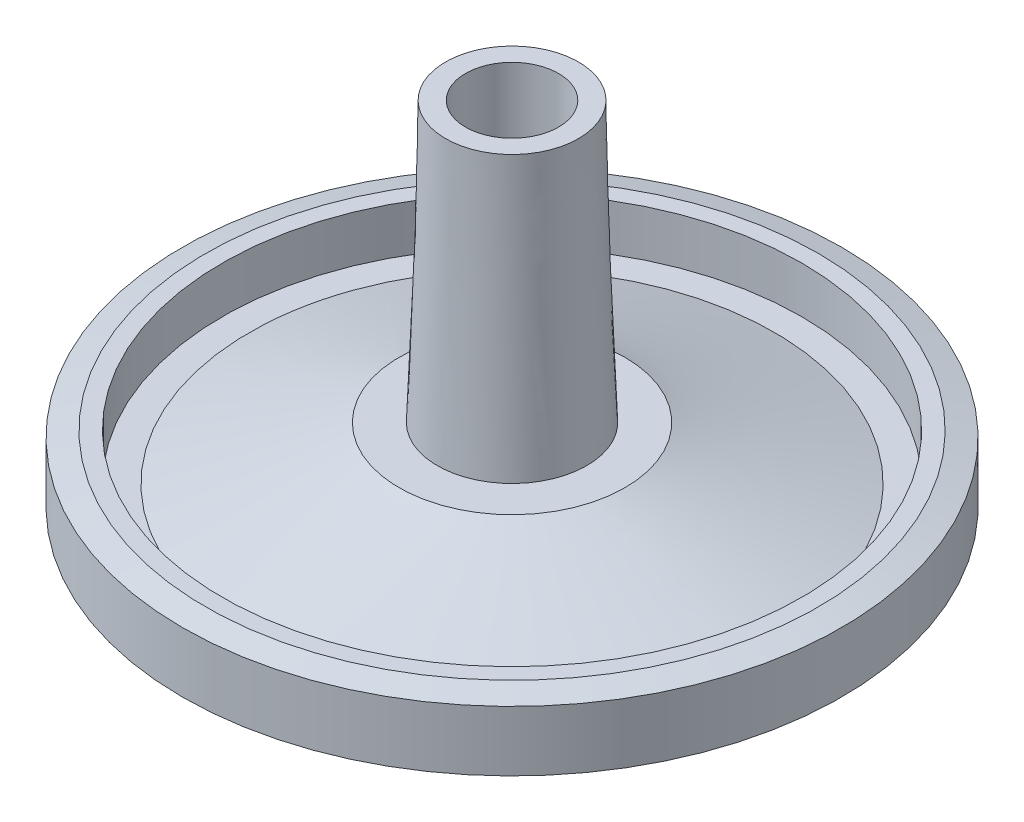
ISO-10303-21;
HEADER;
FILE_DESCRIPTION(('STEP AP214'),'2;1');
FILE_NAME('part.step','',(''),(''),'','','');
FILE_SCHEMA(('AUTOMOTIVE_DESIGN { 1 0 10303 214 1 1 1 1 }'));
ENDSEC;
DATA;
#1=APPLICATION_CONTEXT('core data for automotive mechanical design processes');
#2=APPLICATION_PROTOCOL_DEFINITION('international standard','automotive_design',2000,#1);
#3=PRODUCT_CONTEXT('',#1,'mechanical');
#4=PRODUCT('Part','Part','',(#3));
#5=PRODUCT_RELATED_PRODUCT_CATEGORY('part','',(#4));
#6=PRODUCT_DEFINITION_FORMATION('','',#4);
#7=PRODUCT_DEFINITION_CONTEXT('part definition',#1,'design');
#8=PRODUCT_DEFINITION('design','',#6,#7);
#9=PRODUCT_DEFINITION_SHAPE('','',#8);
#10=(LENGTH_UNIT() NAMED_UNIT(*) SI_UNIT(.MILLI.,.METRE.));
#11=(NAMED_UNIT(*) PLANE_ANGLE_UNIT() SI_UNIT($,.RADIAN.));
#12=(NAMED_UNIT(*) SI_UNIT($,.STERADIAN.) SOLID_ANGLE_UNIT());
#13=UNCERTAINTY_MEASURE_WITH_UNIT(LENGTH_MEASURE(1.E-05),#10,'distance_accuracy_value','');
#14=(GEOMETRIC_REPRESENTATION_CONTEXT(3) GLOBAL_UNCERTAINTY_ASSIGNED_CONTEXT((#13)) GLOBAL_UNIT_ASSIGNED_CONTEXT((#10,
#11,#12)) REPRESENTATION_CONTEXT('',''));
#15=CARTESIAN_POINT('',(0.,0.,0.));
#16=DIRECTION('',(0.,0.,1.));
#17=DIRECTION('',(1.,0.,0.));
#18=AXIS2_PLACEMENT_3D('',#15,#16,#17);
#19=CARTESIAN_POINT('',(0.,-26.5,0.));
#20=DIRECTION('',(0.,-1.,0.));
#21=DIRECTION('',(0.,0.,-1.));
#22=AXIS2_PLACEMENT_3D('',#19,#20,#21);
#23=PLANE('',#22);
#24=CARTESIAN_POINT('',(0.,-26.5,0.));
#25=DIRECTION('',(0.,-1.,0.));
#26=DIRECTION('',(0.,0.,-1.));
#27=AXIS2_PLACEMENT_3D('',#24,#25,#26);
#28=CIRCLE('',#27,19.5);
#29=CARTESIAN_POINT('',(0.,-26.5,-19.5));
#30=VERTEX_POINT('',#29);
#31=EDGE_CURVE('E70',#30,#30,#28,.F.);
#32=ORIENTED_EDGE('',*,*,#31,.T.);
#33=EDGE_LOOP('',(#32));
#34=FACE_BOUND('',#33,.T.);
#35=CARTESIAN_POINT('',(0.,-26.5,0.));
#36=DIRECTION('',(0.,1.,0.));
#37=DIRECTION('',(0.,0.,1.));
#38=AXIS2_PLACEMENT_3D('',#35,#36,#37);
#39=CIRCLE('',#38,20.);
#40=CARTESIAN_POINT('',(0.,-26.5,-20.));
#41=VERTEX_POINT('',#40);
#42=CARTESIAN_POINT('',(0.,-26.5,20.));
#43=VERTEX_POINT('',#42);
#44=EDGE_CURVE('E61',#41,#43,#39,.F.);
#45=ORIENTED_EDGE('',*,*,#44,.T.);
#46=CARTESIAN_POINT('',(0.,-26.5,0.));
#47=DIRECTION('',(0.,1.,0.));
#48=DIRECTION('',(0.,0.,-1.));
#49=AXIS2_PLACEMENT_3D('',#46,#47,#48);
#50=CIRCLE('',#49,20.);
#51=EDGE_CURVE('E58',#43,#41,#50,.F.);
#52=ORIENTED_EDGE('',*,*,#51,.T.);
#53=EDGE_LOOP('',(#45,#52));
#54=FACE_BOUND('',#53,.T.);
#55=ADVANCED_FACE('F17',(#34,#54),#23,.T.);
#56=CARTESIAN_POINT('',(0.,-26.5,0.));
#57=DIRECTION('',(0.,-1.,0.));
#58=DIRECTION('',(0.,0.,-1.));
#59=AXIS2_PLACEMENT_3D('',#56,#57,#58);
#60=CONICAL_SURFACE('',#59,19.5,1.27933953231703);
#61=ORIENTED_EDGE('',*,*,#31,.F.);
#62=EDGE_LOOP('',(#61));
#63=FACE_BOUND('',#62,.T.);
#64=CARTESIAN_POINT('',(0.,-23.5,0.));
#65=DIRECTION('',(0.,-1.,0.));
#66=DIRECTION('',(0.,0.,-1.));
#67=AXIS2_PLACEMENT_3D('',#64,#65,#66);
#68=CIRCLE('',#67,9.5);
#69=CARTESIAN_POINT('',(0.,-23.5,-9.5));
#70=VERTEX_POINT('',#69);
#71=EDGE_CURVE('E65',#70,#70,#68,.T.);
#72=ORIENTED_EDGE('',*,*,#71,.F.);
#73=EDGE_LOOP('',(#72));
#74=FACE_BOUND('',#73,.T.);
#75=ADVANCED_FACE('F119',(#63,#74),#60,.F.);
#76=CARTESIAN_POINT('',(0.,-27.,0.));
#77=DIRECTION('',(0.,-1.,0.));
#78=DIRECTION('',(0.,0.,-1.));
#79=AXIS2_PLACEMENT_3D('',#76,#77,#78);
#80=TOROIDAL_SURFACE('',#79,20.,0.5);
#81=ORIENTED_EDGE('',*,*,#44,.F.);
#82=ORIENTED_EDGE('',*,*,#51,.F.);
#83=EDGE_LOOP('',(#81,#82));
#84=FACE_BOUND('',#83,.T.);
#85=CARTESIAN_POINT('',(0.,-27.,0.));
#86=DIRECTION('',(0.,-1.,0.));
#87=DIRECTION('',(0.,0.,-1.));
#88=AXIS2_PLACEMENT_3D('',#85,#86,#87);
#89=CIRCLE('',#88,20.5);
#90=CARTESIAN_POINT('',(0.,-27.,-20.5));
#91=VERTEX_POINT('',#90);
#92=EDGE_CURVE('E108',#91,#91,#89,.F.);
#93=ORIENTED_EDGE('',*,*,#92,.F.);
#94=EDGE_LOOP('',(#93));
#95=FACE_BOUND('',#94,.T.);
#96=ADVANCED_FACE('F68',(#84,#95),#80,.F.);
#97=CARTESIAN_POINT('',(0.,-23.5,0.));
#98=DIRECTION('',(0.,-1.,0.));
#99=DIRECTION('',(0.,0.,-1.));
#100=AXIS2_PLACEMENT_3D('',#97,#98,#99);
#101=PLANE('',#100);
#102=ORIENTED_EDGE('',*,*,#71,.T.);
#103=EDGE_LOOP('',(#102));
#104=FACE_BOUND('',#103,.T.);
#105=CARTESIAN_POINT('',(0.,-23.5,0.));
#106=DIRECTION('',(0.,1.,0.));
#107=DIRECTION('',(0.,0.,1.));
#108=AXIS2_PLACEMENT_3D('',#105,#106,#107);
#109=CIRCLE('',#108,5.);
#110=CARTESIAN_POINT('',(-4.33535350582245,-23.5,-2.49092552669746));
#111=VERTEX_POINT('',#110);
#112=EDGE_CURVE('E115',#111,#111,#109,.T.);
#113=ORIENTED_EDGE('',*,*,#112,.T.);
#114=EDGE_LOOP('',(#113));
#115=FACE_BOUND('',#114,.T.);
#116=ADVANCED_FACE('F89',(#104,#115),#101,.T.);
#117=CARTESIAN_POINT('',(0.,-27.,0.));
#118=DIRECTION('',(0.,-1.,0.));
#119=DIRECTION('',(0.,0.,-1.));
#120=AXIS2_PLACEMENT_3D('',#117,#118,#119);
#121=TOROIDAL_SURFACE('',#120,21.,0.5);
#122=ORIENTED_EDGE('',*,*,#92,.T.);
#123=EDGE_LOOP('',(#122));
#124=FACE_BOUND('',#123,.T.);
#125=CARTESIAN_POINT('',(0.,-27.5,0.));
#126=DIRECTION('',(0.,-1.,0.));
#127=DIRECTION('',(0.,0.,-1.));
#128=AXIS2_PLACEMENT_3D('',#125,#126,#127);
#129=CIRCLE('',#128,21.);
#130=CARTESIAN_POINT('',(0.,-27.5,21.));
#131=VERTEX_POINT('',#130);
#132=CARTESIAN_POINT('',(0.,-27.5,-21.));
#133=VERTEX_POINT('',#132);
#134=EDGE_CURVE('E103',#131,#133,#129,.F.);
#135=ORIENTED_EDGE('',*,*,#134,.F.);
#136=CARTESIAN_POINT('',(0.,-27.5,0.));
#137=DIRECTION('',(0.,-1.,0.));
#138=DIRECTION('',(0.,0.,1.));
#139=AXIS2_PLACEMENT_3D('',#136,#137,#138);
#140=CIRCLE('',#139,21.);
#141=EDGE_CURVE('E172',#133,#131,#140,.F.);
#142=ORIENTED_EDGE('',*,*,#141,.F.);
#143=EDGE_LOOP('',(#135,#142));
#144=FACE_BOUND('',#143,.T.);
#145=ADVANCED_FACE('F77',(#124,#144),#121,.T.);
#146=CARTESIAN_POINT('',(-4.33535350582245,-23.5,-2.49092552669746));
#147=CARTESIAN_POINT('',(-3.67256262126757,-19.5,0.758144968240403));
#148=CARTESIAN_POINT('',(-9.31720455921736,-23.5,6.17978148494744));
#149=CARTESIAN_POINT('',(-2.15627268478677,-19.5,8.10327021077555));
#150=CARTESIAN_POINT('',(-0.646497547572471,-23.5,11.1616325383424));
#151=CARTESIAN_POINT('',(5.18885255774838,-19.5,6.58698027429475));
#152=CARTESIAN_POINT('',(4.33535350582245,-23.5,2.49092552669746));
#153=CARTESIAN_POINT('',(3.67256262126757,-19.5,-0.758144968240403));
#154=CARTESIAN_POINT('',(9.31720455921737,-23.5,-6.17978148494744));
#155=CARTESIAN_POINT('',(2.15627268478677,-19.5,-8.10327021077554));
#156=CARTESIAN_POINT('',(0.646497547572464,-23.5,-11.1616325383424));
#157=CARTESIAN_POINT('',(-5.18885255774838,-19.5,-6.58698027429474));
#158=CARTESIAN_POINT('',(-4.33535350582245,-23.5,-2.49092552669746));
#159=CARTESIAN_POINT('',(-3.67256262126757,-19.5,0.758144968240403));
#160=(BOUNDED_SURFACE() B_SPLINE_SURFACE(3,1,((#146,#147),(#148,#149),(#150,#151),(#152,#153),
(#154,#155),(#156,#157),(#158,#159)),.UNSPECIFIED.,.T.,.F.,.F.) B_SPLINE_SURFACE_WITH_KNOTS((4,
3,4),(2,2),(0.,0.5,1.),(0.,1.),
.UNSPECIFIED.) GEOMETRIC_REPRESENTATION_ITEM() RATIONAL_B_SPLINE_SURFACE(((1.,1.),
(0.333333333333333,0.333333333333333),(0.333333333333333,0.333333333333333),(1.,1.),
(0.333333333333333,0.333333333333334),(0.333333333333333,0.333333333333334),(1.,1.))) REPRESENTATION_ITEM('') SURFACE());
#161=CARTESIAN_POINT('',(0.,-19.5,0.));
#162=DIRECTION('',(0.,-1.,0.));
#163=DIRECTION('',(0.,0.,-1.));
#164=AXIS2_PLACEMENT_3D('',#161,#162,#163);
#165=CIRCLE('',#164,3.75);
#166=CARTESIAN_POINT('',(-3.67256262126757,-19.5,0.758144968240403));
#167=VERTEX_POINT('',#166);
#168=EDGE_CURVE('E99',#167,#167,#165,.F.);
#169=CARTESIAN_POINT('',(-4.33535350582245,-23.5,-2.49092552669746));
#170=CARTESIAN_POINT('',(-4.32844943410834,-23.4583333333333,-2.45708104237519));
#171=CARTESIAN_POINT('',(-4.32154536239422,-23.4166666666667,-2.42323655805292));
#172=CARTESIAN_POINT('',(-4.30773721896599,-23.3333333333333,-2.35554758940838));
#173=CARTESIAN_POINT('',(-4.30083314725188,-23.2916666666667,-2.32170310508611));
#174=CARTESIAN_POINT('',(-4.28702500382365,-23.2083333333333,-2.25401413644157));
#175=CARTESIAN_POINT('',(-4.28012093210954,-23.1666666666667,-2.2201696521193));
#176=CARTESIAN_POINT('',(-4.26631278868132,-23.0833333333333,-2.15248068347476));
#177=CARTESIAN_POINT('',(-4.2594087169672,-23.0416666666667,-2.11863619915249));
#178=CARTESIAN_POINT('',(-4.24560057353898,-22.9583333333333,-2.05094723050796));
#179=CARTESIAN_POINT('',(-4.23869650182486,-22.9166666666667,-2.01710274618569));
#180=CARTESIAN_POINT('',(-4.22488835839664,-22.8333333333333,-1.94941377754115));
#181=CARTESIAN_POINT('',(-4.21798428668252,-22.7916666666667,-1.91556929321888));
#182=CARTESIAN_POINT('',(-4.2041761432543,-22.7083333333333,-1.84788032457434));
#183=CARTESIAN_POINT('',(-4.19727207154018,-22.6666666666667,-1.81403584025207));
#184=CARTESIAN_POINT('',(-4.18346392811196,-22.5833333333333,-1.74634687160753));
#185=CARTESIAN_POINT('',(-4.17655985639784,-22.5416666666667,-1.71250238728526));
#186=CARTESIAN_POINT('',(-4.16275171296962,-22.4583333333333,-1.64481341864072));
#187=CARTESIAN_POINT('',(-4.1558476412555,-22.4166666666667,-1.61096893431845));
#188=CARTESIAN_POINT('',(-4.14203949782728,-22.3333333333333,-1.54327996567392));
#189=CARTESIAN_POINT('',(-4.13513542611316,-22.2916666666667,-1.50943548135165));
#190=CARTESIAN_POINT('',(-4.12132728268494,-22.2083333333333,-1.44174651270711));
#191=CARTESIAN_POINT('',(-4.11442321097082,-22.1666666666667,-1.40790202838484));
#192=CARTESIAN_POINT('',(-4.1006150675426,-22.0833333333333,-1.3402130597403));
#193=CARTESIAN_POINT('',(-4.09371099582848,-22.0416666666667,-1.30636857541803));
#194=CARTESIAN_POINT('',(-4.07990285240026,-21.9583333333333,-1.23867960677349));
#195=CARTESIAN_POINT('',(-4.07299878068614,-21.9166666666667,-1.20483512245122));
#196=CARTESIAN_POINT('',(-4.05919063725792,-21.8333333333333,-1.13714615380668));
#197=CARTESIAN_POINT('',(-4.0522865655438,-21.7916666666667,-1.10330166948441));
#198=CARTESIAN_POINT('',(-4.03847842211558,-21.7083333333333,-1.03561270083988));
#199=CARTESIAN_POINT('',(-4.03157435040146,-21.6666666666667,-1.00176821651761));
#200=CARTESIAN_POINT('',(-4.01776620697324,-21.5833333333333,-0.934079247873066));
#201=CARTESIAN_POINT('',(-4.01086213525912,-21.5416666666667,-0.900234763550797));
#202=CARTESIAN_POINT('',(-3.9970539918309,-21.4583333333333,-0.832545794906259));
#203=CARTESIAN_POINT('',(-3.99014992011678,-21.4166666666667,-0.798701310583989));
#204=CARTESIAN_POINT('',(-3.97634177668856,-21.3333333333333,-0.73101234193945));
#205=CARTESIAN_POINT('',(-3.96943770497445,-21.2916666666667,-0.697167857617181));
#206=CARTESIAN_POINT('',(-3.95562956154622,-21.2083333333333,-0.629478888972642));
#207=CARTESIAN_POINT('',(-3.9487254898321,-21.1666666666667,-0.595634404650373));
#208=CARTESIAN_POINT('',(-3.93491734640388,-21.0833333333333,-0.527945436005834));
#209=CARTESIAN_POINT('',(-3.92801327468977,-21.0416666666667,-0.494100951683565));
#210=CARTESIAN_POINT('',(-3.91420513126154,-20.9583333333333,-0.426411983039026));
#211=CARTESIAN_POINT('',(-3.90730105954743,-20.9166666666667,-0.392567498716756));
#212=CARTESIAN_POINT('',(-3.8934929161192,-20.8333333333333,-0.324878530072218));
#213=CARTESIAN_POINT('',(-3.88658884440509,-20.7916666666667,-0.291034045749948));
#214=CARTESIAN_POINT('',(-3.87278070097686,-20.7083333333333,-0.223345077105409));
#215=CARTESIAN_POINT('',(-3.86587662926275,-20.6666666666667,-0.18950059278314));
#216=CARTESIAN_POINT('',(-3.85206848583452,-20.5833333333333,-0.121811624138601));
#217=CARTESIAN_POINT('',(-3.84516441412041,-20.5416666666667,-0.0879671398163318));
#218=CARTESIAN_POINT('',(-3.83135627069218,-20.4583333333333,-0.020278171171793));
#219=CARTESIAN_POINT('',(-3.82445219897807,-20.4166666666667,0.0135663131504763));
#220=CARTESIAN_POINT('',(-3.81064405554984,-20.3333333333333,0.0812552817950151));
#221=CARTESIAN_POINT('',(-3.80373998383573,-20.2916666666667,0.115099766117284));
#222=CARTESIAN_POINT('',(-3.7899318404075,-20.2083333333333,0.182788734761823));
#223=CARTESIAN_POINT('',(-3.78302776869339,-20.1666666666667,0.216633219084093));
#224=CARTESIAN_POINT('',(-3.76921962526516,-20.0833333333333,0.284322187728631));
#225=CARTESIAN_POINT('',(-3.76231555355105,-20.0416666666667,0.3181666720509));
#226=CARTESIAN_POINT('',(-3.74850741012282,-19.9583333333333,0.385855640695439));
#227=CARTESIAN_POINT('',(-3.74160333840871,-19.9166666666667,0.419700125017709));
#228=CARTESIAN_POINT('',(-3.72779519498048,-19.8333333333333,0.487389093662248));
#229=CARTESIAN_POINT('',(-3.72089112326637,-19.7916666666667,0.521233577984517));
#230=CARTESIAN_POINT('',(-3.70708297983814,-19.7083333333333,0.588922546629056));
#231=CARTESIAN_POINT('',(-3.70017890812403,-19.6666666666667,0.622767030951325));
#232=CARTESIAN_POINT('',(-3.6863707646958,-19.5833333333333,0.690455999595864));
#233=CARTESIAN_POINT('',(-3.67946669298169,-19.5416666666667,0.724300483918134));
#234=CARTESIAN_POINT('',(-3.67256262126757,-19.5,0.758144968240403));
#235=B_SPLINE_CURVE_WITH_KNOTS('',3,(#169,#170,#171,#172,#173,#174,#175,#176,#177,#178,#179,
#180,#181,#182,#183,#184,#185,#186,#187,#188,#189,#190,#191,#192,#193,#194,#195,#196,#197,#198,
#199,#200,#201,#202,#203,#204,#205,#206,#207,#208,#209,#210,#211,#212,#213,#214,#215,#216,#217,
#218,#219,#220,#221,#222,#223,#224,#225,#226,#227,#228,#229,#230,#231,#232,#233,#234),
.UNSPECIFIED.,.F.,.F.,(4,2,2,2,2,2,2,2,2,2,2,2,2,2,2,2,2,2,2,2,2,2,2,2,2,2,2,2,2,2,2,2,4),(0.,
0.162366985337123,0.324733970674247,0.48710095601137,0.649467941348491,0.811834926685617,
0.97420191202274,1.13656889735986,1.29893588269699,1.46130286803411,1.62366985337123,
1.78603683870836,1.94840382404548,2.1107708093826,2.27313779471973,2.43550478005685,
2.59787176539397,2.76023875073109,2.92260573606822,3.08497272140534,3.24733970674247,
3.40970669207959,3.57207367741671,3.73444066275384,3.89680764809096,4.05917463342808,
4.22154161876521,4.38390860410233,4.54627558943945,4.70864257477657,4.8710095601137,
5.03337654545082,5.19574353078794),.UNSPECIFIED.);
#236=EDGE_CURVE('',#111,#167,#235,.T.);
#237=ORIENTED_EDGE('',*,*,#112,.F.);
#238=ORIENTED_EDGE('',*,*,#168,.T.);
#239=ORIENTED_EDGE('',*,*,#236,.T.);
#240=ORIENTED_EDGE('',*,*,#236,.F.);
#241=EDGE_LOOP('',(#237,#239,#238,#240));
#242=FACE_BOUND('',#241,.T.);
#243=ADVANCED_FACE('F88',(#242),#160,.F.);
#244=CARTESIAN_POINT('',(0.,-27.5,0.));
#245=DIRECTION('',(0.,-1.,0.));
#246=DIRECTION('',(0.,0.,-1.));
#247=AXIS2_PLACEMENT_3D('',#244,#245,#246);
#248=PLANE('',#247);
#249=ORIENTED_EDGE('',*,*,#141,.T.);
#250=ORIENTED_EDGE('',*,*,#134,.T.);
#251=EDGE_LOOP('',(#249,#250));
#252=FACE_BOUND('',#251,.T.);
#253=CARTESIAN_POINT('',(0.,-27.5,0.));
#254=DIRECTION('',(0.,1.,0.));
#255=DIRECTION('',(0.,0.,1.));
#256=AXIS2_PLACEMENT_3D('',#253,#254,#255);
#257=CIRCLE('',#256,22.);
#258=CARTESIAN_POINT('',(0.,-27.5,22.));
#259=VERTEX_POINT('',#258);
#260=CARTESIAN_POINT('',(0.,-27.5,-22.));
#261=VERTEX_POINT('',#260);
#262=EDGE_CURVE('E169',#259,#261,#257,.T.);
#263=ORIENTED_EDGE('',*,*,#262,.F.);
#264=CARTESIAN_POINT('',(0.,-27.5,0.));
#265=DIRECTION('',(0.,1.,0.));
#266=DIRECTION('',(0.,0.,-1.));
#267=AXIS2_PLACEMENT_3D('',#264,#265,#266);
#268=CIRCLE('',#267,22.);
#269=EDGE_CURVE('E275',#261,#259,#268,.T.);
#270=ORIENTED_EDGE('',*,*,#269,.F.);
#271=EDGE_LOOP('',(#263,#270));
#272=FACE_BOUND('',#271,.T.);
#273=ADVANCED_FACE('F247',(#252,#272),#248,.T.);
#274=CARTESIAN_POINT('',(0.,-10.,0.));
#275=DIRECTION('',(0.,-1.,0.));
#276=DIRECTION('',(0.,0.,-1.));
#277=AXIS2_PLACEMENT_3D('',#274,#275,#276);
#278=CYLINDRICAL_SURFACE('',#277,3.75);
#279=ORIENTED_EDGE('',*,*,#168,.F.);
#280=EDGE_LOOP('',(#279));
#281=FACE_BOUND('',#280,.T.);
#282=CARTESIAN_POINT('',(0.,-10.,0.));
#283=DIRECTION('',(0.,-1.,0.));
#284=DIRECTION('',(0.,0.,-1.));
#285=AXIS2_PLACEMENT_3D('',#282,#283,#284);
#286=CIRCLE('',#285,3.75);
#287=CARTESIAN_POINT('',(0.,-10.,-3.75));
#288=VERTEX_POINT('',#287);
#289=EDGE_CURVE('E166',#288,#288,#286,.T.);
#290=ORIENTED_EDGE('',*,*,#289,.F.);
#291=EDGE_LOOP('',(#290));
#292=FACE_BOUND('',#291,.T.);
#293=ADVANCED_FACE('F223',(#281,#292),#278,.F.);
#294=CARTESIAN_POINT('',(0.,-27.,0.));
#295=DIRECTION('',(0.,-1.,0.));
#296=DIRECTION('',(0.,0.,-1.));
#297=AXIS2_PLACEMENT_3D('',#294,#295,#296);
#298=TOROIDAL_SURFACE('',#297,22.,0.5);
#299=ORIENTED_EDGE('',*,*,#269,.T.);
#300=ORIENTED_EDGE('',*,*,#262,.T.);
#301=EDGE_LOOP('',(#299,#300));
#302=FACE_BOUND('',#301,.T.);
#303=CARTESIAN_POINT('',(0.,-27.,0.));
#304=DIRECTION('',(0.,-1.,0.));
#305=DIRECTION('',(0.,0.,-1.));
#306=AXIS2_PLACEMENT_3D('',#303,#304,#305);
#307=CIRCLE('',#306,22.5);
#308=CARTESIAN_POINT('',(0.,-27.,-22.5));
#309=VERTEX_POINT('',#308);
#310=EDGE_CURVE('E165',#309,#309,#307,.T.);
#311=ORIENTED_EDGE('',*,*,#310,.T.);
#312=EDGE_LOOP('',(#311));
#313=FACE_BOUND('',#312,.T.);
#314=ADVANCED_FACE('F219',(#302,#313),#298,.T.);
#315=CARTESIAN_POINT('',(0.,-10.,0.));
#316=DIRECTION('',(0.,-1.,0.));
#317=DIRECTION('',(0.,0.,-1.));
#318=AXIS2_PLACEMENT_3D('',#315,#316,#317);
#319=PLANE('',#318);
#320=ORIENTED_EDGE('',*,*,#289,.T.);
#321=EDGE_LOOP('',(#320));
#322=FACE_BOUND('',#321,.T.);
#323=CARTESIAN_POINT('',(0.,-10.,0.));
#324=DIRECTION('',(0.,-1.,0.));
#325=DIRECTION('',(0.,0.,-1.));
#326=AXIS2_PLACEMENT_3D('',#323,#324,#325);
#327=CIRCLE('',#326,2.5);
#328=CARTESIAN_POINT('',(0.,-10.,-2.5));
#329=VERTEX_POINT('',#328);
#330=EDGE_CURVE('E161',#329,#329,#327,.F.);
#331=ORIENTED_EDGE('',*,*,#330,.T.);
#332=EDGE_LOOP('',(#331));
#333=FACE_BOUND('',#332,.T.);
#334=ADVANCED_FACE('F194',(#322,#333),#319,.T.);
#335=CARTESIAN_POINT('',(0.,-27.,0.));
#336=DIRECTION('',(0.,-1.,0.));
#337=DIRECTION('',(0.,0.,-1.));
#338=AXIS2_PLACEMENT_3D('',#335,#336,#337);
#339=TOROIDAL_SURFACE('',#338,23.,0.5);
#340=ORIENTED_EDGE('',*,*,#310,.F.);
#341=EDGE_LOOP('',(#340));
#342=FACE_BOUND('',#341,.T.);
#343=CARTESIAN_POINT('',(0.,-26.5,0.));
#344=DIRECTION('',(0.,-1.,0.));
#345=DIRECTION('',(0.,0.,1.));
#346=AXIS2_PLACEMENT_3D('',#343,#344,#345);
#347=CIRCLE('',#346,23.);
#348=CARTESIAN_POINT('',(0.,-26.5,-23.));
#349=VERTEX_POINT('',#348);
#350=CARTESIAN_POINT('',(0.,-26.5,23.));
#351=VERTEX_POINT('',#350);
#352=EDGE_CURVE('E164',#349,#351,#347,.F.);
#353=ORIENTED_EDGE('',*,*,#352,.F.);
#354=CARTESIAN_POINT('',(0.,-26.5,0.));
#355=DIRECTION('',(0.,-1.,0.));
#356=DIRECTION('',(0.,0.,-1.));
#357=AXIS2_PLACEMENT_3D('',#354,#355,#356);
#358=CIRCLE('',#357,23.);
#359=EDGE_CURVE('E37',#351,#349,#358,.F.);
#360=ORIENTED_EDGE('',*,*,#359,.F.);
#361=EDGE_LOOP('',(#353,#360));
#362=FACE_BOUND('',#361,.T.);
#363=ADVANCED_FACE('F182',(#342,#362),#339,.F.);
#364=CARTESIAN_POINT('',(0.,0.00209999999999967,0.));
#365=DIRECTION('',(0.,-1.,0.));
#366=DIRECTION('',(0.,0.,-1.));
#367=AXIS2_PLACEMENT_3D('',#364,#365,#366);
#368=CYLINDRICAL_SURFACE('',#367,2.5);
#369=CARTESIAN_POINT('',(0.,-8.5,0.));
#370=DIRECTION('',(0.,-1.,0.));
#371=DIRECTION('',(0.,0.,-1.));
#372=AXIS2_PLACEMENT_3D('',#369,#370,#371);
#373=CIRCLE('',#372,2.5);
#374=CARTESIAN_POINT('',(0.,-8.5,-2.5));
#375=VERTEX_POINT('',#374);
#376=EDGE_CURVE('E158',#375,#375,#373,.T.);
#377=ORIENTED_EDGE('',*,*,#376,.F.);
#378=EDGE_LOOP('',(#377));
#379=FACE_BOUND('',#378,.T.);
#380=ORIENTED_EDGE('',*,*,#330,.F.);
#381=EDGE_LOOP('',(#380));
#382=FACE_BOUND('',#381,.T.);
#383=ADVANCED_FACE('F193',(#379,#382),#368,.F.);
#384=CARTESIAN_POINT('',(0.,-26.5,0.));
#385=DIRECTION('',(0.,-1.,0.));
#386=DIRECTION('',(0.,0.,-1.));
#387=AXIS2_PLACEMENT_3D('',#384,#385,#386);
#388=PLANE('',#387);
#389=CARTESIAN_POINT('',(0.,-26.5,0.));
#390=DIRECTION('',(0.,1.,0.));
#391=DIRECTION('',(0.,0.,1.));
#392=AXIS2_PLACEMENT_3D('',#389,#390,#391);
#393=CIRCLE('',#392,24.8);
#394=CARTESIAN_POINT('',(0.,-26.5,24.8));
#395=VERTEX_POINT('',#394);
#396=EDGE_CURVE('E155',#395,#395,#393,.T.);
#397=ORIENTED_EDGE('',*,*,#396,.F.);
#398=EDGE_LOOP('',(#397));
#399=FACE_BOUND('',#398,.T.);
#400=ORIENTED_EDGE('',*,*,#352,.T.);
#401=ORIENTED_EDGE('',*,*,#359,.T.);
#402=EDGE_LOOP('',(#400,#401));
#403=FACE_BOUND('',#402,.T.);
#404=ADVANCED_FACE('F290',(#399,#403),#388,.T.);
#405=CARTESIAN_POINT('',(0.,-8.5,0.));
#406=DIRECTION('',(0.,1.,0.));
#407=DIRECTION('',(0.,0.,1.));
#408=AXIS2_PLACEMENT_3D('',#405,#406,#407);
#409=PLANE('',#408);
#410=CARTESIAN_POINT('',(0.,-8.5,0.));
#411=DIRECTION('',(0.,1.,0.));
#412=DIRECTION('',(0.,0.,1.));
#413=AXIS2_PLACEMENT_3D('',#410,#411,#412);
#414=CIRCLE('',#413,3.5);
#415=CARTESIAN_POINT('',(0.,-8.5,3.5));
#416=VERTEX_POINT('',#415);
#417=EDGE_CURVE('E152',#416,#416,#414,.T.);
#418=ORIENTED_EDGE('',*,*,#417,.T.);
#419=EDGE_LOOP('',(#418));
#420=FACE_BOUND('',#419,.T.);
#421=ORIENTED_EDGE('',*,*,#376,.T.);
#422=EDGE_LOOP('',(#421));
#423=FACE_BOUND('',#422,.T.);
#424=ADVANCED_FACE('F296',(#420,#423),#409,.T.);
#425=CARTESIAN_POINT('',(0.,-26.5,0.));
#426=DIRECTION('',(0.,1.,0.));
#427=DIRECTION('',(0.,0.,1.));
#428=AXIS2_PLACEMENT_3D('',#425,#426,#427);
#429=CYLINDRICAL_SURFACE('',#428,24.8);
#430=ORIENTED_EDGE('',*,*,#396,.T.);
#431=EDGE_LOOP('',(#430));
#432=FACE_BOUND('',#431,.T.);
#433=CARTESIAN_POINT('',(0.,-21.9689110867545,0.));
#434=DIRECTION('',(0.,-1.,0.));
#435=DIRECTION('',(0.,0.,-1.));
#436=AXIS2_PLACEMENT_3D('',#433,#434,#435);
#437=CIRCLE('',#436,24.8);
#438=CARTESIAN_POINT('',(0.,-21.9689110867545,-24.8));
#439=VERTEX_POINT('',#438);
#440=EDGE_CURVE('E151',#439,#439,#437,.F.);
#441=ORIENTED_EDGE('',*,*,#440,.F.);
#442=EDGE_LOOP('',(#441));
#443=FACE_BOUND('',#442,.T.);
#444=ADVANCED_FACE('F352',(#432,#443),#429,.T.);
#445=CARTESIAN_POINT('',(0.,-8.5,0.));
#446=DIRECTION('',(0.,1.,0.));
#447=DIRECTION('',(0.,0.,1.));
#448=AXIS2_PLACEMENT_3D('',#445,#446,#447);
#449=CYLINDRICAL_SURFACE('',#448,3.5);
#450=CARTESIAN_POINT('',(0.,0.,0.));
#451=DIRECTION('',(0.,1.,0.));
#452=DIRECTION('',(0.,0.,1.));
#453=AXIS2_PLACEMENT_3D('',#450,#451,#452);
#454=CIRCLE('',#453,3.5);
#455=CARTESIAN_POINT('',(0.,0.,3.5));
#456=VERTEX_POINT('',#455);
#457=EDGE_CURVE('E148',#456,#456,#454,.F.);
#458=ORIENTED_EDGE('',*,*,#457,.F.);
#459=EDGE_LOOP('',(#458));
#460=FACE_BOUND('',#459,.T.);
#461=ORIENTED_EDGE('',*,*,#417,.F.);
#462=EDGE_LOOP('',(#461));
#463=FACE_BOUND('',#462,.T.);
#464=ADVANCED_FACE('F348',(#460,#463),#449,.F.);
#465=CARTESIAN_POINT('',(0.,-21.9689110867545,0.));
#466=DIRECTION('',(0.,-1.,0.));
#467=DIRECTION('',(0.,0.,-1.));
#468=AXIS2_PLACEMENT_3D('',#465,#466,#467);
#469=CONICAL_SURFACE('',#468,24.8,1.30899693899575);
#470=CARTESIAN_POINT('',(0.,-21.5,0.));
#471=DIRECTION('',(0.,-1.,0.));
#472=DIRECTION('',(0.,0.,-1.));
#473=AXIS2_PLACEMENT_3D('',#470,#471,#472);
#474=CIRCLE('',#473,23.05);
#475=CARTESIAN_POINT('',(0.,-21.5,-23.05));
#476=VERTEX_POINT('',#475);
#477=EDGE_CURVE('E145',#476,#476,#474,.T.);
#478=ORIENTED_EDGE('',*,*,#477,.T.);
#479=EDGE_LOOP('',(#478));
#480=FACE_BOUND('',#479,.T.);
#481=ORIENTED_EDGE('',*,*,#440,.T.);
#482=EDGE_LOOP('',(#481));
#483=FACE_BOUND('',#482,.T.);
#484=ADVANCED_FACE('F344',(#480,#483),#469,.T.);
#485=CARTESIAN_POINT('',(0.,0.,0.));
#486=DIRECTION('',(0.,1.,0.));
#487=DIRECTION('',(0.,0.,1.));
#488=AXIS2_PLACEMENT_3D('',#485,#486,#487);
#489=PLANE('',#488);
#490=CARTESIAN_POINT('',(0.,0.,0.));
#491=DIRECTION('',(0.,-1.,0.));
#492=DIRECTION('',(0.,0.,-1.));
#493=AXIS2_PLACEMENT_3D('',#490,#491,#492);
#494=CIRCLE('',#493,5.);
#495=CARTESIAN_POINT('',(-3.03965148847302,0.,-3.96995199323918));
#496=VERTEX_POINT('',#495);
#497=EDGE_CURVE('E142',#496,#496,#494,.T.);
#498=ORIENTED_EDGE('',*,*,#497,.F.);
#499=EDGE_LOOP('',(#498));
#500=FACE_BOUND('',#499,.T.);
#501=ORIENTED_EDGE('',*,*,#457,.T.);
#502=EDGE_LOOP('',(#501));
#503=FACE_BOUND('',#502,.T.);
#504=ADVANCED_FACE('F340',(#500,#503),#489,.T.);
#505=CARTESIAN_POINT('',(0.,-21.5,0.));
#506=DIRECTION('',(0.,-1.,0.));
#507=DIRECTION('',(0.,0.,-1.));
#508=AXIS2_PLACEMENT_3D('',#505,#506,#507);
#509=PLANE('',#508);
#510=CARTESIAN_POINT('',(0.,-21.5,0.));
#511=DIRECTION('',(0.,-1.,0.));
#512=DIRECTION('',(0.,0.,-1.));
#513=AXIS2_PLACEMENT_3D('',#510,#511,#512);
#514=CIRCLE('',#513,21.8);
#515=CARTESIAN_POINT('',(0.,-21.5,-21.8));
#516=VERTEX_POINT('',#515);
#517=EDGE_CURVE('E139',#516,#516,#514,.T.);
#518=ORIENTED_EDGE('',*,*,#517,.T.);
#519=EDGE_LOOP('',(#518));
#520=FACE_BOUND('',#519,.T.);
#521=ORIENTED_EDGE('',*,*,#477,.F.);
#522=EDGE_LOOP('',(#521));
#523=FACE_BOUND('',#522,.T.);
#524=ADVANCED_FACE('F331',(#520,#523),#509,.F.);
#525=CARTESIAN_POINT('',(-3.03965148847302,0.,-3.96995199323918));
#526=CARTESIAN_POINT('',(-4.73413450025371,-21.,-3.03786035451065));
#527=CARTESIAN_POINT('',(-4.75107933037152,-21.21,-3.02853943812337));
#528=CARTESIAN_POINT('',(4.90025249800534,0.,-10.0492549701852));
#529=CARTESIAN_POINT('',(1.34158620876759,-21.,-12.5061293550181));
#530=CARTESIAN_POINT('',(1.30599954587521,-21.21,-12.5306980988664));
#531=CARTESIAN_POINT('',(10.9795554749514,0.,-2.10935098370686));
#532=CARTESIAN_POINT('',(10.809855209275,-21.,-6.43040864599677));
#533=CARTESIAN_POINT('',(10.8081582066182,-21.21,-6.47361922261967));
#534=CARTESIAN_POINT('',(3.03965148847302,0.,3.96995199323918));
#535=CARTESIAN_POINT('',(4.73413450025371,-21.,3.03786035451065));
#536=CARTESIAN_POINT('',(4.75107933037152,-21.21,3.02853943812336));
#537=CARTESIAN_POINT('',(-4.90025249800533,0.,10.0492549701852));
#538=CARTESIAN_POINT('',(-1.34158620876759,-21.,12.5061293550181));
#539=CARTESIAN_POINT('',(-1.30599954587521,-21.21,12.5306980988664));
#540=CARTESIAN_POINT('',(-10.9795554749514,0.,2.10935098370686));
#541=CARTESIAN_POINT('',(-10.809855209275,-21.,6.43040864599677));
#542=CARTESIAN_POINT('',(-10.8081582066182,-21.21,6.47361922261966));
#543=CARTESIAN_POINT('',(-3.03965148847302,0.,-3.96995199323918));
#544=CARTESIAN_POINT('',(-4.73413450025371,-21.,-3.03786035451065));
#545=CARTESIAN_POINT('',(-4.75107933037152,-21.21,-3.02853943812337));
#546=(BOUNDED_SURFACE() B_SPLINE_SURFACE(3,1,((#525,#526,#527),(#528,#529,#530),(#531,#532,
#533),(#534,#535,#536),(#537,#538,#539),(#540,#541,#542),(#543,#544,#545)),.UNSPECIFIED.,.T.,
.F.,.F.) B_SPLINE_SURFACE_WITH_KNOTS((4,3,4),(2,1,2),(0.,0.5,1.),(0.,1.,1.01),
.UNSPECIFIED.) GEOMETRIC_REPRESENTATION_ITEM() RATIONAL_B_SPLINE_SURFACE(((1.,1.,1.),
(0.333333333333333,0.333333333333333,0.333333333333333),(0.333333333333333,0.333333333333333,
0.333333333333333),(1.,1.,1.),(0.333333333333334,0.333333333333333,0.333333333333333),
(0.333333333333334,0.333333333333333,0.333333333333333),(1.,1.,1.))) REPRESENTATION_ITEM('') SURFACE());
#547=CARTESIAN_POINT('',(0.,-21.,0.));
#548=DIRECTION('',(0.,-1.,0.));
#549=DIRECTION('',(0.,0.,-1.));
#550=AXIS2_PLACEMENT_3D('',#547,#548,#549);
#551=CIRCLE('',#550,5.625);
#552=CARTESIAN_POINT('',(-4.73413450025371,-21.,-3.03786035451065));
#553=VERTEX_POINT('',#552);
#554=EDGE_CURVE('E136',#553,#553,#551,.F.);
#555=CARTESIAN_POINT('',(-3.03965148847302,0.,-3.96995199323918));
#556=CARTESIAN_POINT('',(-3.05730235317907,-0.21875,-3.96024270533576));
#557=CARTESIAN_POINT('',(-3.07495321788512,-0.4375,-3.95053341743234));
#558=CARTESIAN_POINT('',(-3.11025494729722,-0.875,-3.93111484162549));
#559=CARTESIAN_POINT('',(-3.12790581200326,-1.09375,-3.92140555372207));
#560=CARTESIAN_POINT('',(-3.16320754141536,-1.53125,-3.90198697791523));
#561=CARTESIAN_POINT('',(-3.18085840612141,-1.75,-3.89227769001181));
#562=CARTESIAN_POINT('',(-3.21616013553351,-2.1875,-3.87285911420496));
#563=CARTESIAN_POINT('',(-3.23381100023956,-2.40625,-3.86314982630154));
#564=CARTESIAN_POINT('',(-3.26911272965166,-2.84375,-3.84373125049469));
#565=CARTESIAN_POINT('',(-3.2867635943577,-3.0625,-3.83402196259127));
#566=CARTESIAN_POINT('',(-3.3220653237698,-3.5,-3.81460338678443));
#567=CARTESIAN_POINT('',(-3.33971618847585,-3.71875,-3.80489409888101));
#568=CARTESIAN_POINT('',(-3.37501791788795,-4.15625,-3.78547552307416));
#569=CARTESIAN_POINT('',(-3.392668782594,-4.375,-3.77576623517074));
#570=CARTESIAN_POINT('',(-3.4279705120061,-4.8125,-3.75634765936389));
#571=CARTESIAN_POINT('',(-3.44562137671214,-5.03125,-3.74663837146047));
#572=CARTESIAN_POINT('',(-3.48092310612424,-5.46875,-3.72721979565363));
#573=CARTESIAN_POINT('',(-3.49857397083029,-5.6875,-3.71751050775021));
#574=CARTESIAN_POINT('',(-3.53387570024239,-6.125,-3.69809193194336));
#575=CARTESIAN_POINT('',(-3.55152656494844,-6.34375,-3.68838264403994));
#576=CARTESIAN_POINT('',(-3.58682829436053,-6.78125,-3.66896406823309));
#577=CARTESIAN_POINT('',(-3.60447915906658,-7.,-3.65925478032967));
#578=CARTESIAN_POINT('',(-3.63978088847868,-7.4375,-3.63983620452283));
#579=CARTESIAN_POINT('',(-3.65743175318473,-7.65625,-3.63012691661941));
#580=CARTESIAN_POINT('',(-3.69273348259683,-8.09375,-3.61070834081256));
#581=CARTESIAN_POINT('',(-3.71038434730288,-8.3125,-3.60099905290914));
#582=CARTESIAN_POINT('',(-3.74568607671497,-8.75,-3.58158047710229));
#583=CARTESIAN_POINT('',(-3.76333694142102,-8.96875,-3.57187118919887));
#584=CARTESIAN_POINT('',(-3.79863867083312,-9.40625,-3.55245261339203));
#585=CARTESIAN_POINT('',(-3.81628953553917,-9.625,-3.54274332548861));
#586=CARTESIAN_POINT('',(-3.85159126495127,-10.0625,-3.52332474968176));
#587=CARTESIAN_POINT('',(-3.86924212965732,-10.28125,-3.51361546177834));
#588=CARTESIAN_POINT('',(-3.90454385906941,-10.71875,-3.49419688597149));
#589=CARTESIAN_POINT('',(-3.92219472377546,-10.9375,-3.48448759806807));
#590=CARTESIAN_POINT('',(-3.95749645318756,-11.375,-3.46506902226123));
#591=CARTESIAN_POINT('',(-3.97514731789361,-11.59375,-3.45535973435781));
#592=CARTESIAN_POINT('',(-4.01044904730571,-12.03125,-3.43594115855096));
#593=CARTESIAN_POINT('',(-4.02809991201176,-12.25,-3.42623187064754));
#594=CARTESIAN_POINT('',(-4.06340164142385,-12.6875,-3.40681329484069));
#595=CARTESIAN_POINT('',(-4.0810525061299,-12.90625,-3.39710400693727));
#596=CARTESIAN_POINT('',(-4.116354235542,-13.34375,-3.37768543113043));
#597=CARTESIAN_POINT('',(-4.13400510024805,-13.5625,-3.36797614322701));
#598=CARTESIAN_POINT('',(-4.16930682966015,-14.,-3.34855756742016));
#599=CARTESIAN_POINT('',(-4.18695769436619,-14.21875,-3.33884827951674));
#600=CARTESIAN_POINT('',(-4.22225942377829,-14.65625,-3.31942970370989));
#601=CARTESIAN_POINT('',(-4.23991028848434,-14.875,-3.30972041580647));
#602=CARTESIAN_POINT('',(-4.27521201789644,-15.3125,-3.29030183999963));
#603=CARTESIAN_POINT('',(-4.29286288260249,-15.53125,-3.28059255209621));
#604=CARTESIAN_POINT('',(-4.32816461201459,-15.96875,-3.26117397628936));
#605=CARTESIAN_POINT('',(-4.34581547672063,-16.1875,-3.25146468838594));
#606=CARTESIAN_POINT('',(-4.38111720613273,-16.625,-3.23204611257909));
#607=CARTESIAN_POINT('',(-4.39876807083878,-16.84375,-3.22233682467567));
#608=CARTESIAN_POINT('',(-4.43406980025088,-17.28125,-3.20291824886883));
#609=CARTESIAN_POINT('',(-4.45172066495693,-17.5,-3.19320896096541));
#610=CARTESIAN_POINT('',(-4.48702239436903,-17.9375,-3.17379038515856));
#611=CARTESIAN_POINT('',(-4.50467325907507,-18.15625,-3.16408109725514));
#612=CARTESIAN_POINT('',(-4.53997498848717,-18.59375,-3.1446625214483));
#613=CARTESIAN_POINT('',(-4.55762585319322,-18.8125,-3.13495323354487));
#614=CARTESIAN_POINT('',(-4.59292758260532,-19.25,-3.11553465773803));
#615=CARTESIAN_POINT('',(-4.61057844731137,-19.46875,-3.10582536983461));
#616=CARTESIAN_POINT('',(-4.64588017672346,-19.90625,-3.08640679402776));
#617=CARTESIAN_POINT('',(-4.66353104142951,-20.125,-3.07669750612434));
#618=CARTESIAN_POINT('',(-4.69883277084161,-20.5625,-3.0572789303175));
#619=CARTESIAN_POINT('',(-4.71648363554766,-20.78125,-3.04756964241407));
#620=CARTESIAN_POINT('',(-4.73413450025371,-21.,-3.03786035451065));
#621=B_SPLINE_CURVE_WITH_KNOTS('',3,(#555,#556,#557,#558,#559,#560,#561,#562,#563,#564,#565,
#566,#567,#568,#569,#570,#571,#572,#573,#574,#575,#576,#577,#578,#579,#580,#581,#582,#583,#584,
#585,#586,#587,#588,#589,#590,#591,#592,#593,#594,#595,#596,#597,#598,#599,#600,#601,#602,#603,
#604,#605,#606,#607,#608,#609,#610,#611,#612,#613,#614,#615,#616,#617,#618,#619,#620),
.UNSPECIFIED.,.F.,.F.,(4,2,2,2,2,2,2,2,2,2,2,2,2,2,2,2,2,2,2,2,2,2,2,2,2,2,2,2,2,2,2,2,4),(0.,
0.659026913083347,1.31805382616669,1.97708073925004,2.63610765233339,3.29513456541673,
3.95416147850008,4.61318839158343,5.27221530466677,5.93124221775012,6.59026913083347,
7.24929604391682,7.90832295700016,8.56734987008351,9.22637678316686,9.8854036962502,
10.5444306093335,11.2034575224169,11.8624844355002,12.5215113485836,13.1805382616669,
13.8395651747503,14.4985920878336,15.157619000917,15.8166459140003,16.4756728270837,
17.134699740167,17.7937266532504,18.4527535663337,19.1117804794171,19.7708073925004,
20.4298343055838,21.0888612186671),.UNSPECIFIED.);
#622=EDGE_CURVE('',#496,#553,#621,.T.);
#623=ORIENTED_EDGE('',*,*,#497,.T.);
#624=ORIENTED_EDGE('',*,*,#554,.T.);
#625=ORIENTED_EDGE('',*,*,#622,.T.);
#626=ORIENTED_EDGE('',*,*,#622,.F.);
#627=EDGE_LOOP('',(#623,#625,#624,#626));
#628=FACE_BOUND('',#627,.T.);
#629=ADVANCED_FACE('F325',(#628),#546,.T.);
#630=CARTESIAN_POINT('',(0.,-21.5,0.));
#631=DIRECTION('',(0.,-1.,0.));
#632=DIRECTION('',(0.,0.,-1.));
#633=AXIS2_PLACEMENT_3D('',#630,#631,#632);
#634=CYLINDRICAL_SURFACE('',#633,21.8);
#635=ORIENTED_EDGE('',*,*,#517,.F.);
#636=EDGE_LOOP('',(#635));
#637=FACE_BOUND('',#636,.T.);
#638=CARTESIAN_POINT('',(0.,-25.,0.));
#639=DIRECTION('',(0.,-1.,0.));
#640=DIRECTION('',(0.,0.,-1.));
#641=AXIS2_PLACEMENT_3D('',#638,#639,#640);
#642=CIRCLE('',#641,21.8);
#643=CARTESIAN_POINT('',(0.,-25.,-21.8));
#644=VERTEX_POINT('',#643);
#645=EDGE_CURVE('E133',#644,#644,#642,.T.);
#646=ORIENTED_EDGE('',*,*,#645,.T.);
#647=EDGE_LOOP('',(#646));
#648=FACE_BOUND('',#647,.T.);
#649=ADVANCED_FACE('F321',(#637,#648),#634,.F.);
#650=CARTESIAN_POINT('',(0.,-21.,0.));
#651=DIRECTION('',(0.,-1.,0.));
#652=DIRECTION('',(0.,0.,-1.));
#653=AXIS2_PLACEMENT_3D('',#650,#651,#652);
#654=PLANE('',#653);
#655=ORIENTED_EDGE('',*,*,#554,.F.);
#656=EDGE_LOOP('',(#655));
#657=FACE_BOUND('',#656,.T.);
#658=CARTESIAN_POINT('',(0.,-21.,0.));
#659=DIRECTION('',(0.,-1.,0.));
#660=DIRECTION('',(0.,0.,-1.));
#661=AXIS2_PLACEMENT_3D('',#658,#659,#660);
#662=CIRCLE('',#661,8.5);
#663=CARTESIAN_POINT('',(-8.49291214191159,-21.,0.347049491817338));
#664=VERTEX_POINT('',#663);
#665=EDGE_CURVE('E29',#664,#664,#662,.T.);
#666=ORIENTED_EDGE('',*,*,#665,.F.);
#667=EDGE_LOOP('',(#666));
#668=FACE_BOUND('',#667,.T.);
#669=ADVANCED_FACE('F307',(#657,#668),#654,.F.);
#670=CARTESIAN_POINT('',(0.,-25.,0.));
#671=DIRECTION('',(0.,-1.,0.));
#672=DIRECTION('',(0.,0.,-1.));
#673=AXIS2_PLACEMENT_3D('',#670,#671,#672);
#674=PLANE('',#673);
#675=ORIENTED_EDGE('',*,*,#645,.F.);
#676=EDGE_LOOP('',(#675));
#677=FACE_BOUND('',#676,.T.);
#678=CARTESIAN_POINT('',(0.,-25.,0.));
#679=DIRECTION('',(0.,-1.,0.));
#680=DIRECTION('',(0.,0.,-1.));
#681=AXIS2_PLACEMENT_3D('',#678,#679,#680);
#682=CIRCLE('',#681,19.75);
#683=CARTESIAN_POINT('',(-17.8597529408905,-25.,-8.43159088727343));
#684=VERTEX_POINT('',#683);
#685=EDGE_CURVE('E11',#684,#684,#682,.F.);
#686=ORIENTED_EDGE('',*,*,#685,.F.);
#687=EDGE_LOOP('',(#686));
#688=FACE_BOUND('',#687,.T.);
#689=ADVANCED_FACE('F301',(#677,#688),#674,.F.);
#690=CARTESIAN_POINT('',(-8.49291214191159,-21.,0.347049491817338));
#691=CARTESIAN_POINT('',(-17.8597529408905,-25.,-8.43159088727343));
#692=CARTESIAN_POINT('',(-9.18701112554627,-21.,-16.6387747920058));
#693=CARTESIAN_POINT('',(-0.996571166343656,-25.,-44.1510967690545));
#694=CARTESIAN_POINT('',(7.79881315827691,-21.,-17.3328737756405));
#695=CARTESIAN_POINT('',(34.7229347154374,-25.,-27.2879149945076));
#696=CARTESIAN_POINT('',(8.49291214191159,-21.,-0.347049491817344));
#697=CARTESIAN_POINT('',(17.8597529408905,-25.,8.43159088727345));
#698=CARTESIAN_POINT('',(9.18701112554628,-21.,16.6387747920058));
#699=CARTESIAN_POINT('',(0.996571166343628,-25.,44.1510967690545));
#700=CARTESIAN_POINT('',(-7.7988131582769,-21.,17.3328737756405));
#701=CARTESIAN_POINT('',(-34.7229347154374,-25.,27.2879149945076));
#702=CARTESIAN_POINT('',(-8.49291214191159,-21.,0.347049491817338));
#703=CARTESIAN_POINT('',(-17.8597529408905,-25.,-8.43159088727343));
#704=(BOUNDED_SURFACE() B_SPLINE_SURFACE(3,1,((#690,#691),(#692,#693),(#694,#695),(#696,#697),
(#698,#699),(#700,#701),(#702,#703)),.UNSPECIFIED.,.T.,.F.,.F.) B_SPLINE_SURFACE_WITH_KNOTS((4,
3,4),(2,2),(0.,0.5,1.),(0.,1.),
.UNSPECIFIED.) GEOMETRIC_REPRESENTATION_ITEM() RATIONAL_B_SPLINE_SURFACE(((1.,1.),
(0.333333333333334,0.333333333333333),(0.333333333333334,0.333333333333333),(1.,1.),
(0.333333333333333,0.333333333333333),(0.333333333333333,0.333333333333333),(1.,1.))) REPRESENTATION_ITEM('') SURFACE());
#705=CARTESIAN_POINT('',(-17.8597529408905,-25.,-8.43159088727343));
#706=CARTESIAN_POINT('',(-17.7621816825678,-24.9583333333333,-8.3401467166579));
#707=CARTESIAN_POINT('',(-17.6646104242451,-24.9166666666667,-8.24870254604237));
#708=CARTESIAN_POINT('',(-17.4694679075997,-24.8333333333333,-8.06581420481131));
#709=CARTESIAN_POINT('',(-17.371896649277,-24.7916666666667,-7.97437003419578));
#710=CARTESIAN_POINT('',(-17.1767541326316,-24.7083333333333,-7.79148169296473));
#711=CARTESIAN_POINT('',(-17.0791828743089,-24.6666666666667,-7.7000375223492));
#712=CARTESIAN_POINT('',(-16.8840403576636,-24.5833333333333,-7.51714918111814));
#713=CARTESIAN_POINT('',(-16.7864690993409,-24.5416666666667,-7.42570501050261));
#714=CARTESIAN_POINT('',(-16.5913265826955,-24.4583333333333,-7.24281666927155));
#715=CARTESIAN_POINT('',(-16.4937553243728,-24.4166666666667,-7.15137249865603));
#716=CARTESIAN_POINT('',(-16.2986128077274,-24.3333333333333,-6.96848415742497));
#717=CARTESIAN_POINT('',(-16.2010415494047,-24.2916666666667,-6.87703998680944));
#718=CARTESIAN_POINT('',(-16.0058990327593,-24.2083333333333,-6.69415164557838));
#719=CARTESIAN_POINT('',(-15.9083277744366,-24.1666666666667,-6.60270747496285));
#720=CARTESIAN_POINT('',(-15.7131852577912,-24.0833333333333,-6.41981913373179));
#721=CARTESIAN_POINT('',(-15.6156139994685,-24.0416666666667,-6.32837496311627));
#722=CARTESIAN_POINT('',(-15.4204714828231,-23.9583333333333,-6.14548662188521));
#723=CARTESIAN_POINT('',(-15.3229002245004,-23.9166666666667,-6.05404245126968));
#724=CARTESIAN_POINT('',(-15.127757707855,-23.8333333333333,-5.87115411003862));
#725=CARTESIAN_POINT('',(-15.0301864495323,-23.7916666666667,-5.77970993942309));
#726=CARTESIAN_POINT('',(-14.8350439328869,-23.7083333333333,-5.59682159819203));
#727=CARTESIAN_POINT('',(-14.7374726745642,-23.6666666666667,-5.50537742757651));
#728=CARTESIAN_POINT('',(-14.5423301579188,-23.5833333333333,-5.32248908634545));
#729=CARTESIAN_POINT('',(-14.4447588995961,-23.5416666666667,-5.23104491572992));
#730=CARTESIAN_POINT('',(-14.2496163829507,-23.4583333333333,-5.04815657449886));
#731=CARTESIAN_POINT('',(-14.152045124628,-23.4166666666667,-4.95671240388333));
#732=CARTESIAN_POINT('',(-13.9569026079826,-23.3333333333333,-4.77382406265227));
#733=CARTESIAN_POINT('',(-13.8593313496599,-23.2916666666667,-4.68237989203675));
#734=CARTESIAN_POINT('',(-13.6641888330145,-23.2083333333333,-4.49949155080569));
#735=CARTESIAN_POINT('',(-13.5666175746918,-23.1666666666667,-4.40804738019016));
#736=CARTESIAN_POINT('',(-13.3714750580465,-23.0833333333333,-4.2251590389591));
#737=CARTESIAN_POINT('',(-13.2739037997238,-23.0416666666667,-4.13371486834357));
#738=CARTESIAN_POINT('',(-13.0787612830784,-22.9583333333333,-3.95082652711252));
#739=CARTESIAN_POINT('',(-12.9811900247557,-22.9166666666667,-3.85938235649699));
#740=CARTESIAN_POINT('',(-12.7860475081103,-22.8333333333333,-3.67649401526593));
#741=CARTESIAN_POINT('',(-12.6884762497876,-22.7916666666667,-3.5850498446504));
#742=CARTESIAN_POINT('',(-12.4933337331422,-22.7083333333333,-3.40216150341934));
#743=CARTESIAN_POINT('',(-12.3957624748195,-22.6666666666667,-3.31071733280381));
#744=CARTESIAN_POINT('',(-12.2006199581741,-22.5833333333333,-3.12782899157276));
#745=CARTESIAN_POINT('',(-12.1030486998514,-22.5416666666667,-3.03638482095723));
#746=CARTESIAN_POINT('',(-11.907906183206,-22.4583333333333,-2.85349647972617));
#747=CARTESIAN_POINT('',(-11.8103349248833,-22.4166666666667,-2.76205230911064));
#748=CARTESIAN_POINT('',(-11.6151924082379,-22.3333333333333,-2.57916396787958));
#749=CARTESIAN_POINT('',(-11.5176211499152,-22.2916666666667,-2.48771979726406));
#750=CARTESIAN_POINT('',(-11.3224786332698,-22.2083333333333,-2.304831456033));
#751=CARTESIAN_POINT('',(-11.2249073749471,-22.1666666666667,-2.21338728541747));
#752=CARTESIAN_POINT('',(-11.0297648583017,-22.0833333333333,-2.03049894418641));
#753=CARTESIAN_POINT('',(-10.932193599979,-22.0416666666667,-1.93905477357088));
#754=CARTESIAN_POINT('',(-10.7370510833336,-21.9583333333333,-1.75616643233982));
#755=CARTESIAN_POINT('',(-10.6394798250109,-21.9166666666667,-1.6647222617243));
#756=CARTESIAN_POINT('',(-10.4443373083655,-21.8333333333333,-1.48183392049324));
#757=CARTESIAN_POINT('',(-10.3467660500428,-21.7916666666667,-1.39038974987771));
#758=CARTESIAN_POINT('',(-10.1516235333974,-21.7083333333333,-1.20750140864665));
#759=CARTESIAN_POINT('',(-10.0540522750747,-21.6666666666667,-1.11605723803112));
#760=CARTESIAN_POINT('',(-9.85890975842935,-21.5833333333333,-0.933168896800065));
#761=CARTESIAN_POINT('',(-9.76133850010666,-21.5416666666667,-0.841724726184537));
#762=CARTESIAN_POINT('',(-9.56619598346126,-21.4583333333333,-0.658836384953479));
#763=CARTESIAN_POINT('',(-9.46862472513856,-21.4166666666667,-0.567392214337951));
#764=CARTESIAN_POINT('',(-9.27348220849317,-21.3333333333333,-0.384503873106893));
#765=CARTESIAN_POINT('',(-9.17591095017047,-21.2916666666667,-0.293059702491364));
#766=CARTESIAN_POINT('',(-8.98076843352508,-21.2083333333333,-0.110171361260306));
#767=CARTESIAN_POINT('',(-8.88319717520238,-21.1666666666667,-0.0187271906447774));
#768=CARTESIAN_POINT('',(-8.68805465855699,-21.0833333333333,0.16416115058628));
#769=CARTESIAN_POINT('',(-8.59048340023429,-21.0416666666667,0.255605321201808));
#770=CARTESIAN_POINT('',(-8.49291214191159,-21.,0.347049491817338));
#771=B_SPLINE_CURVE_WITH_KNOTS('',3,(#705,#706,#707,#708,#709,#710,#711,#712,#713,#714,#715,
#716,#717,#718,#719,#720,#721,#722,#723,#724,#725,#726,#727,#728,#729,#730,#731,#732,#733,#734,
#735,#736,#737,#738,#739,#740,#741,#742,#743,#744,#745,#746,#747,#748,#749,#750,#751,#752,#753,
#754,#755,#756,#757,#758,#759,#760,#761,#762,#763,#764,#765,#766,#767,#768,#769,#770),
.UNSPECIFIED.,.F.,.F.,(4,2,2,2,2,2,2,2,2,2,2,2,2,2,2,2,2,2,2,2,2,2,2,2,2,2,2,2,2,2,2,2,4),(0.,
0.420196003208178,0.840392006416358,1.26058800962454,1.68078401283272,2.1009800160409,
2.52117601924907,2.94137202245725,3.36156802566543,3.78176402887361,4.20196003208179,
4.62215603528997,5.04235203849815,5.46254804170633,5.88274404491451,6.30294004812269,
6.72313605133087,7.14333205453905,7.56352805774723,7.9837240609554,8.40392006416358,
8.82411606737177,9.24431207057994,9.66450807378812,10.0847040769963,10.5049000802045,
10.9250960834127,11.3452920866208,11.765488089829,12.1856840930372,12.6058800962454,
13.0260760994536,13.4462721026617),.UNSPECIFIED.);
#772=EDGE_CURVE('',#684,#664,#771,.T.);
#773=ORIENTED_EDGE('',*,*,#685,.T.);
#774=ORIENTED_EDGE('',*,*,#665,.T.);
#775=ORIENTED_EDGE('',*,*,#772,.T.);
#776=ORIENTED_EDGE('',*,*,#772,.F.);
#777=EDGE_LOOP('',(#773,#775,#774,#776));
#778=FACE_BOUND('',#777,.T.);
#779=ADVANCED_FACE('F299',(#778),#704,.T.);
#780=CLOSED_SHELL('',(#55,#75,#96,#116,#145,#243,#273,#293,#314,#334,#363,#383,#404,#424,#444,
#464,#484,#504,#524,#629,#649,#669,#689,#779));
#781=MANIFOLD_SOLID_BREP('B1',#780);
#782=ADVANCED_BREP_SHAPE_REPRESENTATION('',(#18,#781),#14);
#783=SHAPE_DEFINITION_REPRESENTATION(#9,#782);
ENDSEC;
END-ISO-10303-21;
